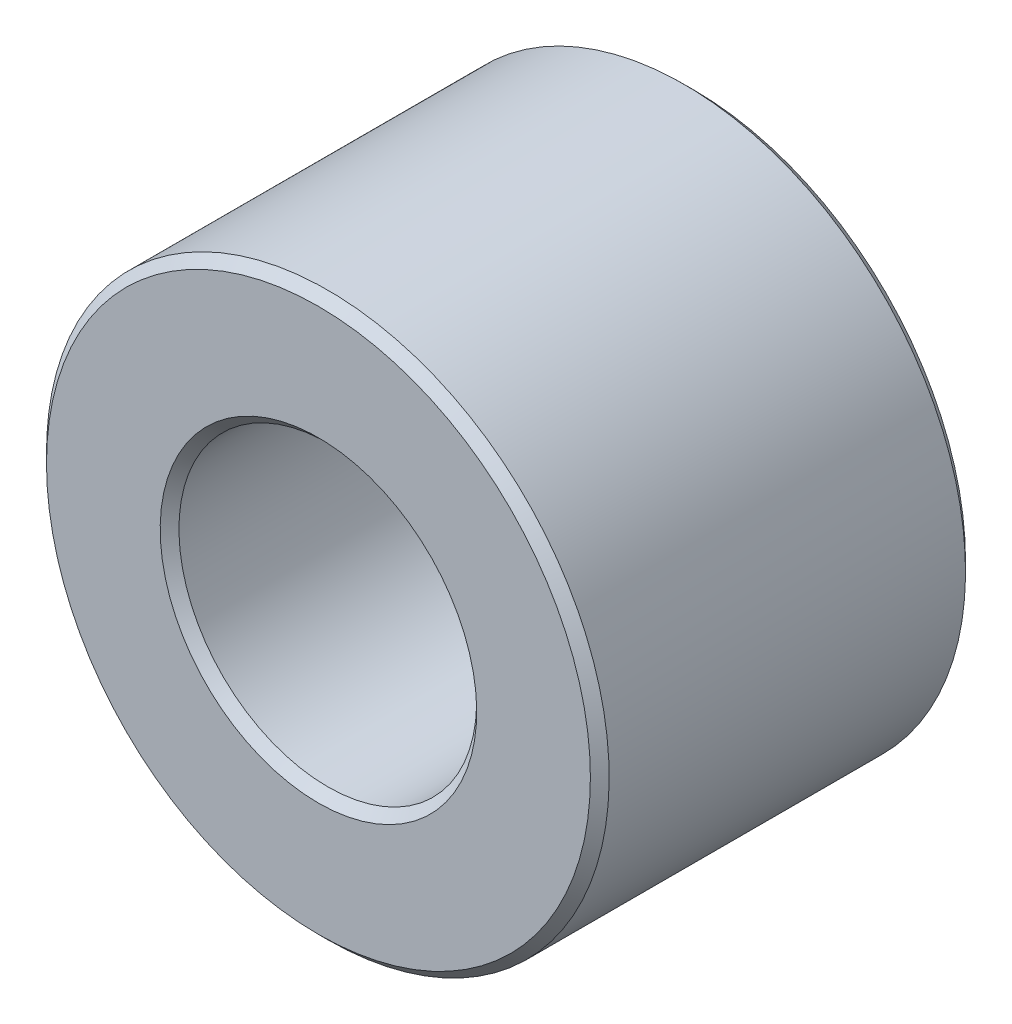
ISO-10303-21;
HEADER;
FILE_DESCRIPTION(('STEP AP214'),'2;1');
FILE_NAME('part.step','',(''),(''),'','','');
FILE_SCHEMA(('AUTOMOTIVE_DESIGN { 1 0 10303 214 1 1 1 1 }'));
ENDSEC;
DATA;
#1=APPLICATION_CONTEXT('core data for automotive mechanical design processes');
#2=APPLICATION_PROTOCOL_DEFINITION('international standard','automotive_design',2000,#1);
#3=PRODUCT_CONTEXT('',#1,'mechanical');
#4=PRODUCT('Part','Part','',(#3));
#5=PRODUCT_RELATED_PRODUCT_CATEGORY('part','',(#4));
#6=PRODUCT_DEFINITION_FORMATION('','',#4);
#7=PRODUCT_DEFINITION_CONTEXT('part definition',#1,'design');
#8=PRODUCT_DEFINITION('design','',#6,#7);
#9=PRODUCT_DEFINITION_SHAPE('','',#8);
#10=(LENGTH_UNIT() NAMED_UNIT(*) SI_UNIT(.MILLI.,.METRE.));
#11=(NAMED_UNIT(*) PLANE_ANGLE_UNIT() SI_UNIT($,.RADIAN.));
#12=(NAMED_UNIT(*) SI_UNIT($,.STERADIAN.) SOLID_ANGLE_UNIT());
#13=UNCERTAINTY_MEASURE_WITH_UNIT(LENGTH_MEASURE(1.E-05),#10,'distance_accuracy_value','');
#14=(GEOMETRIC_REPRESENTATION_CONTEXT(3) GLOBAL_UNCERTAINTY_ASSIGNED_CONTEXT((#13)) GLOBAL_UNIT_ASSIGNED_CONTEXT((#10,
#11,#12)) REPRESENTATION_CONTEXT('',''));
#15=CARTESIAN_POINT('',(0.,0.,0.));
#16=DIRECTION('',(0.,0.,1.));
#17=DIRECTION('',(1.,0.,0.));
#18=AXIS2_PLACEMENT_3D('',#15,#16,#17);
#19=CARTESIAN_POINT('',(0.,-1.65592377923915E-12,-1.05000000000006));
#20=DIRECTION('',(0.,0.,-1.));
#21=DIRECTION('',(0.,1.,0.));
#22=AXIS2_PLACEMENT_3D('',#19,#20,#21);
#23=CONICAL_SURFACE('',#22,2.95,0.785398163397491);
#24=CARTESIAN_POINT('',(0.,-1.65585117609857E-12,-1.10000000000006));
#25=DIRECTION('',(0.,0.,-1.));
#26=DIRECTION('',(1.,0.,0.));
#27=AXIS2_PLACEMENT_3D('',#24,#25,#26);
#28=CIRCLE('',#27,3.);
#29=CARTESIAN_POINT('',(0.,-3.00000000000166,-1.10000000000006));
#30=VERTEX_POINT('',#29);
#31=EDGE_CURVE('E90',#30,#30,#28,.T.);
#32=ORIENTED_EDGE('',*,*,#31,.F.);
#33=DIRECTION('',(0.,0.707106781186577,0.707106781186518));
#34=VECTOR('',#33,1.);
#35=CARTESIAN_POINT('',(0.,-2.95000000000166,-1.05000000000007));
#36=LINE('',#35,#34);
#37=CARTESIAN_POINT('',(0.,-2.90000000000166,-1.00000000000007));
#38=VERTEX_POINT('',#37);
#39=EDGE_CURVE('E11',#30,#38,#36,.T.);
#40=ORIENTED_EDGE('',*,*,#39,.T.);
#41=CARTESIAN_POINT('',(0.,-1.65599638237972E-12,-1.00000000000007));
#42=DIRECTION('',(0.,0.,-1.));
#43=DIRECTION('',(1.,0.,0.));
#44=AXIS2_PLACEMENT_3D('',#41,#42,#43);
#45=CIRCLE('',#44,2.9);
#46=EDGE_CURVE('E19',#38,#38,#45,.T.);
#47=ORIENTED_EDGE('',*,*,#46,.T.);
#48=ORIENTED_EDGE('',*,*,#39,.F.);
#49=EDGE_LOOP('',(#32,#40,#47,#48));
#50=FACE_BOUND('',#49,.T.);
#51=ADVANCED_FACE('F16',(#50),#23,.T.);
#52=CARTESIAN_POINT('',(0.,2.89999999999835,-1.00000000000006));
#53=DIRECTION('',(0.,0.,1.));
#54=DIRECTION('',(0.,-1.,0.));
#55=AXIS2_PLACEMENT_3D('',#52,#53,#54);
#56=PLANE('',#55);
#57=CARTESIAN_POINT('',(0.,-1.65599638237972E-12,-1.00000000000007));
#58=DIRECTION('',(0.,0.,-1.));
#59=DIRECTION('',(1.,0.,0.));
#60=AXIS2_PLACEMENT_3D('',#57,#58,#59);
#61=CIRCLE('',#60,1.6875);
#62=CARTESIAN_POINT('',(0.,-1.68750000000166,-1.00000000000007));
#63=VERTEX_POINT('',#62);
#64=EDGE_CURVE('E42',#63,#63,#61,.T.);
#65=ORIENTED_EDGE('',*,*,#64,.T.);
#66=EDGE_LOOP('',(#65));
#67=FACE_BOUND('',#66,.T.);
#68=ORIENTED_EDGE('',*,*,#46,.F.);
#69=EDGE_LOOP('',(#68));
#70=FACE_BOUND('',#69,.T.);
#71=ADVANCED_FACE('F121',(#67,#70),#56,.T.);
#72=CARTESIAN_POINT('',(0.,-1.65592377923915E-12,-1.05000000000007));
#73=DIRECTION('',(0.,0.,1.));
#74=DIRECTION('',(0.,1.,0.));
#75=AXIS2_PLACEMENT_3D('',#72,#73,#74);
#76=CONICAL_SURFACE('',#75,1.6375,0.78539816339745);
#77=CARTESIAN_POINT('',(0.,-1.65585117609857E-12,-1.10000000000006));
#78=DIRECTION('',(0.,0.,-1.));
#79=DIRECTION('',(1.,0.,0.));
#80=AXIS2_PLACEMENT_3D('',#77,#78,#79);
#81=CIRCLE('',#80,1.5875);
#82=CARTESIAN_POINT('',(0.,-1.58750000000166,-1.10000000000007));
#83=VERTEX_POINT('',#82);
#84=EDGE_CURVE('E104',#83,#83,#81,.T.);
#85=ORIENTED_EDGE('',*,*,#84,.T.);
#86=DIRECTION('',(0.,-0.70710678118655,0.707106781186545));
#87=VECTOR('',#86,1.);
#88=CARTESIAN_POINT('',(0.,-1.63750000000166,-1.05000000000007));
#89=LINE('',#88,#87);
#90=EDGE_CURVE('E110',#83,#63,#89,.T.);
#91=ORIENTED_EDGE('',*,*,#90,.T.);
#92=ORIENTED_EDGE('',*,*,#64,.F.);
#93=ORIENTED_EDGE('',*,*,#90,.F.);
#94=EDGE_LOOP('',(#85,#91,#92,#93));
#95=FACE_BOUND('',#94,.T.);
#96=ADVANCED_FACE('F123',(#95),#76,.F.);
#97=CARTESIAN_POINT('',(0.,-1.65447171642765E-12,-2.05000000000007));
#98=DIRECTION('',(0.,0.,-1.));
#99=DIRECTION('',(0.,1.,0.));
#100=AXIS2_PLACEMENT_3D('',#97,#98,#99);
#101=CYLINDRICAL_SURFACE('',#100,1.5875);
#102=CARTESIAN_POINT('',(0.,-1.65033333741488E-12,-4.90000000000007));
#103=DIRECTION('',(0.,0.,-1.));
#104=DIRECTION('',(1.,0.,0.));
#105=AXIS2_PLACEMENT_3D('',#102,#103,#104);
#106=CIRCLE('',#105,1.5875);
#107=CARTESIAN_POINT('',(0.,-1.58750000000165,-4.90000000000007));
#108=VERTEX_POINT('',#107);
#109=EDGE_CURVE('E86',#108,#108,#106,.T.);
#110=ORIENTED_EDGE('',*,*,#109,.T.);
#111=DIRECTION('',(0.,0.,1.));
#112=VECTOR('',#111,1.);
#113=CARTESIAN_POINT('',(0.,-1.58750000000166,-2.05000000000007));
#114=LINE('',#113,#112);
#115=EDGE_CURVE('E93',#108,#83,#114,.T.);
#116=ORIENTED_EDGE('',*,*,#115,.T.);
#117=ORIENTED_EDGE('',*,*,#84,.F.);
#118=ORIENTED_EDGE('',*,*,#115,.F.);
#119=EDGE_LOOP('',(#110,#116,#117,#118));
#120=FACE_BOUND('',#119,.T.);
#121=ADVANCED_FACE('F129',(#120),#101,.F.);
#122=CARTESIAN_POINT('',(0.,-1.65447171642765E-12,-2.05000000000006));
#123=DIRECTION('',(0.,0.,-1.));
#124=DIRECTION('',(0.,1.,0.));
#125=AXIS2_PLACEMENT_3D('',#122,#123,#124);
#126=CYLINDRICAL_SURFACE('',#125,3.);
#127=CARTESIAN_POINT('',(0.,-1.65033333741488E-12,-4.90000000000007));
#128=DIRECTION('',(0.,0.,-1.));
#129=DIRECTION('',(1.,0.,0.));
#130=AXIS2_PLACEMENT_3D('',#127,#128,#129);
#131=CIRCLE('',#130,3.);
#132=CARTESIAN_POINT('',(0.,-3.00000000000166,-4.90000000000008));
#133=VERTEX_POINT('',#132);
#134=EDGE_CURVE('E84',#133,#133,#131,.T.);
#135=ORIENTED_EDGE('',*,*,#134,.F.);
#136=DIRECTION('',(0.,0.,1.));
#137=VECTOR('',#136,1.);
#138=CARTESIAN_POINT('',(0.,-3.00000000000166,-2.05000000000007));
#139=LINE('',#138,#137);
#140=EDGE_CURVE('E94',#133,#30,#139,.T.);
#141=ORIENTED_EDGE('',*,*,#140,.T.);
#142=ORIENTED_EDGE('',*,*,#31,.T.);
#143=ORIENTED_EDGE('',*,*,#140,.F.);
#144=EDGE_LOOP('',(#135,#141,#142,#143));
#145=FACE_BOUND('',#144,.T.);
#146=ADVANCED_FACE('F135',(#145),#126,.T.);
#147=CARTESIAN_POINT('',(0.,-1.6502607342743E-12,-4.95000000000007));
#148=DIRECTION('',(0.,0.,1.));
#149=DIRECTION('',(0.,1.,0.));
#150=AXIS2_PLACEMENT_3D('',#147,#148,#149);
#151=CONICAL_SURFACE('',#150,2.95,0.785398163397491);
#152=ORIENTED_EDGE('',*,*,#134,.T.);
#153=DIRECTION('',(0.,0.707106781186579,-0.707106781186516));
#154=VECTOR('',#153,1.);
#155=CARTESIAN_POINT('',(0.,-2.95000000000166,-4.95000000000007));
#156=LINE('',#155,#154);
#157=CARTESIAN_POINT('',(0.,-2.90000000000166,-5.00000000000007));
#158=VERTEX_POINT('',#157);
#159=EDGE_CURVE('E95',#133,#158,#156,.T.);
#160=ORIENTED_EDGE('',*,*,#159,.T.);
#161=CARTESIAN_POINT('',(0.,-1.65018813113373E-12,-5.00000000000006));
#162=DIRECTION('',(0.,0.,-1.));
#163=DIRECTION('',(1.,0.,0.));
#164=AXIS2_PLACEMENT_3D('',#161,#162,#163);
#165=CIRCLE('',#164,2.9);
#166=EDGE_CURVE('E77',#158,#158,#165,.T.);
#167=ORIENTED_EDGE('',*,*,#166,.F.);
#168=ORIENTED_EDGE('',*,*,#159,.F.);
#169=EDGE_LOOP('',(#152,#160,#167,#168));
#170=FACE_BOUND('',#169,.T.);
#171=ADVANCED_FACE('F137',(#170),#151,.T.);
#172=CARTESIAN_POINT('',(0.,2.89999999999836,-5.00000000000006));
#173=DIRECTION('',(0.,0.,1.));
#174=DIRECTION('',(0.,-1.,0.));
#175=AXIS2_PLACEMENT_3D('',#172,#173,#174);
#176=PLANE('',#175);
#177=CARTESIAN_POINT('',(0.,-1.65018813113373E-12,-5.00000000000006));
#178=DIRECTION('',(0.,0.,-1.));
#179=DIRECTION('',(1.,0.,0.));
#180=AXIS2_PLACEMENT_3D('',#177,#178,#179);
#181=CIRCLE('',#180,1.6875);
#182=CARTESIAN_POINT('',(0.,-1.68750000000165,-5.00000000000007));
#183=VERTEX_POINT('',#182);
#184=EDGE_CURVE('E70',#183,#183,#181,.T.);
#185=ORIENTED_EDGE('',*,*,#184,.F.);
#186=EDGE_LOOP('',(#185));
#187=FACE_BOUND('',#186,.T.);
#188=ORIENTED_EDGE('',*,*,#166,.T.);
#189=EDGE_LOOP('',(#188));
#190=FACE_BOUND('',#189,.T.);
#191=ADVANCED_FACE('F140',(#187,#190),#176,.F.);
#192=CARTESIAN_POINT('',(0.,-1.6502607342743E-12,-4.95000000000007));
#193=DIRECTION('',(0.,0.,-1.));
#194=DIRECTION('',(0.,1.,0.));
#195=AXIS2_PLACEMENT_3D('',#192,#193,#194);
#196=CONICAL_SURFACE('',#195,1.6375,0.78539816339745);
#197=ORIENTED_EDGE('',*,*,#109,.F.);
#198=DIRECTION('',(0.,-0.707106781186548,-0.707106781186547));
#199=VECTOR('',#198,1.);
#200=CARTESIAN_POINT('',(0.,-1.63750000000165,-4.95000000000007));
#201=LINE('',#200,#199);
#202=EDGE_CURVE('E73',#108,#183,#201,.T.);
#203=ORIENTED_EDGE('',*,*,#202,.T.);
#204=ORIENTED_EDGE('',*,*,#184,.T.);
#205=ORIENTED_EDGE('',*,*,#202,.F.);
#206=EDGE_LOOP('',(#197,#203,#204,#205));
#207=FACE_BOUND('',#206,.T.);
#208=ADVANCED_FACE('F72',(#207),#196,.F.);
#209=CLOSED_SHELL('',(#51,#71,#96,#121,#146,#171,#191,#208));
#210=MANIFOLD_SOLID_BREP('B1',#209);
#211=ADVANCED_BREP_SHAPE_REPRESENTATION('',(#18,#210),#14);
#212=SHAPE_DEFINITION_REPRESENTATION(#9,#211);
ENDSEC;
END-ISO-10303-21;
